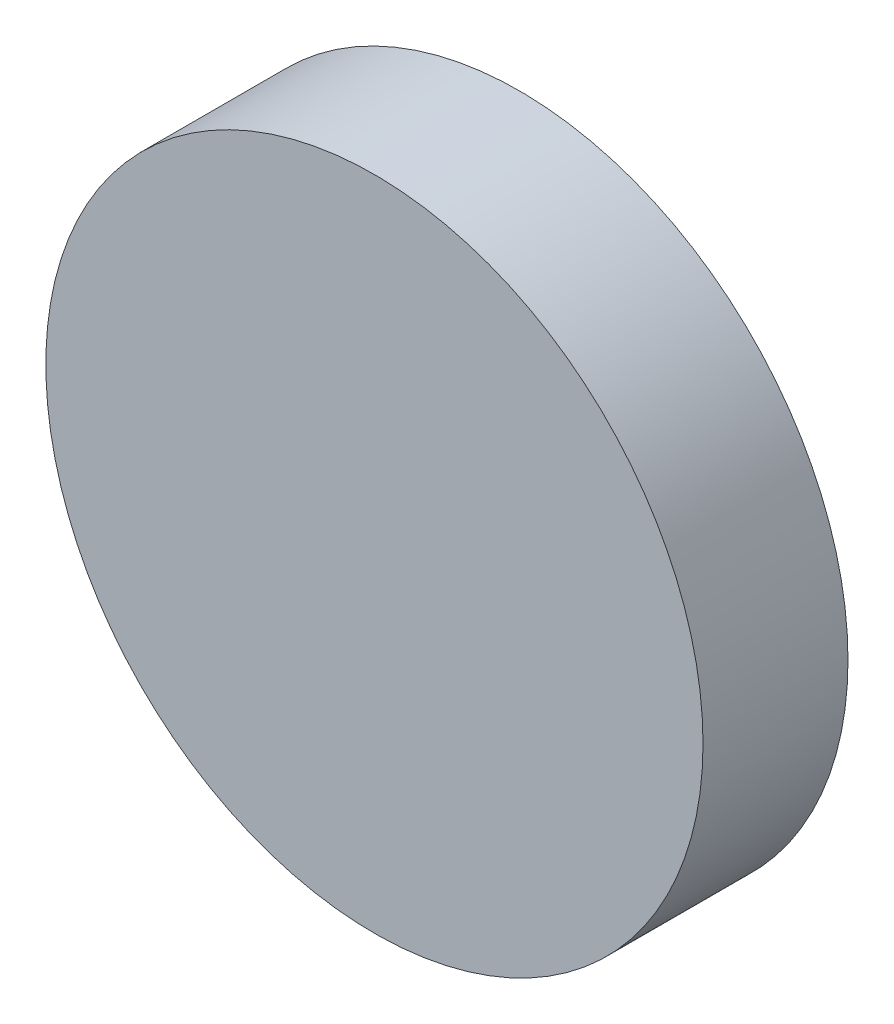
ISO-10303-21;
HEADER;
FILE_DESCRIPTION(('STEP AP214'),'2;1');
FILE_NAME('part.step','',(''),(''),'','','');
FILE_SCHEMA(('AUTOMOTIVE_DESIGN { 1 0 10303 214 1 1 1 1 }'));
ENDSEC;
DATA;
#1=APPLICATION_CONTEXT('core data for automotive mechanical design processes');
#2=APPLICATION_PROTOCOL_DEFINITION('international standard','automotive_design',2000,#1);
#3=PRODUCT_CONTEXT('',#1,'mechanical');
#4=PRODUCT('Part','Part','',(#3));
#5=PRODUCT_RELATED_PRODUCT_CATEGORY('part','',(#4));
#6=PRODUCT_DEFINITION_FORMATION('','',#4);
#7=PRODUCT_DEFINITION_CONTEXT('part definition',#1,'design');
#8=PRODUCT_DEFINITION('design','',#6,#7);
#9=PRODUCT_DEFINITION_SHAPE('','',#8);
#10=(LENGTH_UNIT() NAMED_UNIT(*) SI_UNIT(.MILLI.,.METRE.));
#11=(NAMED_UNIT(*) PLANE_ANGLE_UNIT() SI_UNIT($,.RADIAN.));
#12=(NAMED_UNIT(*) SI_UNIT($,.STERADIAN.) SOLID_ANGLE_UNIT());
#13=UNCERTAINTY_MEASURE_WITH_UNIT(LENGTH_MEASURE(1.E-05),#10,'distance_accuracy_value','');
#14=(GEOMETRIC_REPRESENTATION_CONTEXT(3) GLOBAL_UNCERTAINTY_ASSIGNED_CONTEXT((#13)) GLOBAL_UNIT_ASSIGNED_CONTEXT((#10,
#11,#12)) REPRESENTATION_CONTEXT('',''));
#15=CARTESIAN_POINT('',(0.,0.,0.));
#16=DIRECTION('',(0.,0.,1.));
#17=DIRECTION('',(1.,0.,0.));
#18=AXIS2_PLACEMENT_3D('',#15,#16,#17);
#19=CARTESIAN_POINT('',(0.,0.,0.9));
#20=DIRECTION('',(0.,0.,-1.));
#21=DIRECTION('',(-1.,0.,0.));
#22=AXIS2_PLACEMENT_3D('',#19,#20,#21);
#23=CYLINDRICAL_SURFACE('',#22,2.04);
#24=CARTESIAN_POINT('',(0.,0.,0.9));
#25=DIRECTION('',(0.,0.,1.));
#26=DIRECTION('',(1.,0.,0.));
#27=AXIS2_PLACEMENT_3D('',#24,#25,#26);
#28=CIRCLE('',#27,2.04);
#29=CARTESIAN_POINT('',(2.04,0.,0.9));
#30=VERTEX_POINT('',#29);
#31=EDGE_CURVE('E10',#30,#30,#28,.T.);
#32=ORIENTED_EDGE('',*,*,#31,.F.);
#33=EDGE_LOOP('',(#32));
#34=FACE_BOUND('',#33,.T.);
#35=CARTESIAN_POINT('',(0.,0.,0.));
#36=DIRECTION('',(0.,0.,1.));
#37=DIRECTION('',(1.,0.,0.));
#38=AXIS2_PLACEMENT_3D('',#35,#36,#37);
#39=CIRCLE('',#38,2.04);
#40=CARTESIAN_POINT('',(2.04,0.,0.));
#41=VERTEX_POINT('',#40);
#42=EDGE_CURVE('E33',#41,#41,#39,.T.);
#43=ORIENTED_EDGE('',*,*,#42,.T.);
#44=EDGE_LOOP('',(#43));
#45=FACE_BOUND('',#44,.T.);
#46=ADVANCED_FACE('F30',(#34,#45),#23,.T.);
#47=CARTESIAN_POINT('',(0.,0.,0.9));
#48=DIRECTION('',(0.,0.,1.));
#49=DIRECTION('',(1.,0.,0.));
#50=AXIS2_PLACEMENT_3D('',#47,#48,#49);
#51=PLANE('',#50);
#52=ORIENTED_EDGE('',*,*,#31,.T.);
#53=EDGE_LOOP('',(#52));
#54=FACE_BOUND('',#53,.T.);
#55=ADVANCED_FACE('F45',(#54),#51,.T.);
#56=CARTESIAN_POINT('',(0.,0.,0.));
#57=DIRECTION('',(0.,0.,1.));
#58=DIRECTION('',(1.,0.,0.));
#59=AXIS2_PLACEMENT_3D('',#56,#57,#58);
#60=PLANE('',#59);
#61=ORIENTED_EDGE('',*,*,#42,.F.);
#62=EDGE_LOOP('',(#61));
#63=FACE_BOUND('',#62,.T.);
#64=ADVANCED_FACE('F43',(#63),#60,.F.);
#65=CLOSED_SHELL('',(#46,#55,#64));
#66=MANIFOLD_SOLID_BREP('B2',#65);
#67=ADVANCED_BREP_SHAPE_REPRESENTATION('',(#18,#66),#14);
#68=SHAPE_DEFINITION_REPRESENTATION(#9,#67);
ENDSEC;
END-ISO-10303-21;
